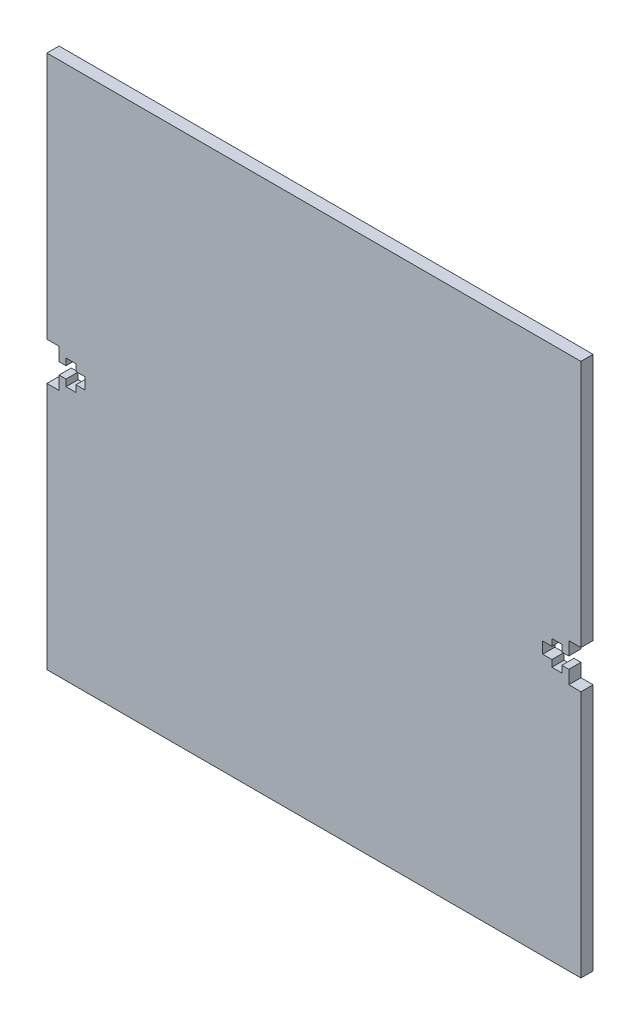
ISO-10303-21;
HEADER;
FILE_DESCRIPTION(('STEP AP214'),'2;1');
FILE_NAME('part.step','',(''),(''),'','','');
FILE_SCHEMA(('AUTOMOTIVE_DESIGN { 1 0 10303 214 1 1 1 1 }'));
ENDSEC;
DATA;
#1=APPLICATION_CONTEXT('core data for automotive mechanical design processes');
#2=APPLICATION_PROTOCOL_DEFINITION('international standard','automotive_design',2000,#1);
#3=PRODUCT_CONTEXT('',#1,'mechanical');
#4=PRODUCT('Part','Part','',(#3));
#5=PRODUCT_RELATED_PRODUCT_CATEGORY('part','',(#4));
#6=PRODUCT_DEFINITION_FORMATION('','',#4);
#7=PRODUCT_DEFINITION_CONTEXT('part definition',#1,'design');
#8=PRODUCT_DEFINITION('design','',#6,#7);
#9=PRODUCT_DEFINITION_SHAPE('','',#8);
#10=(LENGTH_UNIT() NAMED_UNIT(*) SI_UNIT(.MILLI.,.METRE.));
#11=(NAMED_UNIT(*) PLANE_ANGLE_UNIT() SI_UNIT($,.RADIAN.));
#12=(NAMED_UNIT(*) SI_UNIT($,.STERADIAN.) SOLID_ANGLE_UNIT());
#13=UNCERTAINTY_MEASURE_WITH_UNIT(LENGTH_MEASURE(1.E-05),#10,'distance_accuracy_value','');
#14=(GEOMETRIC_REPRESENTATION_CONTEXT(3) GLOBAL_UNCERTAINTY_ASSIGNED_CONTEXT((#13)) GLOBAL_UNIT_ASSIGNED_CONTEXT((#10,
#11,#12)) REPRESENTATION_CONTEXT('',''));
#15=CARTESIAN_POINT('',(0.,0.,0.));
#16=DIRECTION('',(0.,0.,1.));
#17=DIRECTION('',(1.,0.,0.));
#18=AXIS2_PLACEMENT_3D('',#15,#16,#17);
#19=CARTESIAN_POINT('',(69.85,69.85,3.18));
#20=DIRECTION('',(-1.,0.,0.));
#21=DIRECTION('',(0.,-1.,0.));
#22=AXIS2_PLACEMENT_3D('',#19,#20,#21);
#23=PLANE('',#22);
#24=DIRECTION('',(0.,1.,0.));
#25=VECTOR('',#24,1.);
#26=CARTESIAN_POINT('',(69.85,69.85,3.18));
#27=LINE('',#26,#25);
#28=CARTESIAN_POINT('',(69.85,5.00000000000001,3.18));
#29=VERTEX_POINT('',#28);
#30=CARTESIAN_POINT('',(69.85,69.85,3.18));
#31=VERTEX_POINT('',#30);
#32=EDGE_CURVE('E512',#29,#31,#27,.T.);
#33=ORIENTED_EDGE('',*,*,#32,.F.);
#34=DIRECTION('',(0.,0.,-1.));
#35=VECTOR('',#34,1.);
#36=CARTESIAN_POINT('',(69.85,5.00000000000001,10.));
#37=LINE('',#36,#35);
#38=CARTESIAN_POINT('',(69.85,5.00000000000001,0.));
#39=VERTEX_POINT('',#38);
#40=EDGE_CURVE('E329',#29,#39,#37,.T.);
#41=ORIENTED_EDGE('',*,*,#40,.T.);
#42=DIRECTION('',(0.,1.,0.));
#43=VECTOR('',#42,1.);
#44=CARTESIAN_POINT('',(69.85,69.85,0.));
#45=LINE('',#44,#43);
#46=CARTESIAN_POINT('',(69.85,69.85,0.));
#47=VERTEX_POINT('',#46);
#48=EDGE_CURVE('E477',#39,#47,#45,.T.);
#49=ORIENTED_EDGE('',*,*,#48,.T.);
#50=DIRECTION('',(0.,0.,-1.));
#51=VECTOR('',#50,1.);
#52=CARTESIAN_POINT('',(69.85,69.85,3.18));
#53=LINE('',#52,#51);
#54=EDGE_CURVE('E11',#31,#47,#53,.T.);
#55=ORIENTED_EDGE('',*,*,#54,.F.);
#56=EDGE_LOOP('',(#33,#41,#49,#55));
#57=FACE_BOUND('',#56,.T.);
#58=ADVANCED_FACE('F35',(#57),#23,.F.);
#59=CARTESIAN_POINT('',(-69.85,69.85,3.18));
#60=DIRECTION('',(1.,0.,0.));
#61=DIRECTION('',(0.,0.,-1.));
#62=AXIS2_PLACEMENT_3D('',#59,#60,#61);
#63=PLANE('',#62);
#64=DIRECTION('',(0.,-1.,0.));
#65=VECTOR('',#64,1.);
#66=CARTESIAN_POINT('',(-69.85,69.85,0.));
#67=LINE('',#66,#65);
#68=CARTESIAN_POINT('',(-69.85,69.85,0.));
#69=VERTEX_POINT('',#68);
#70=CARTESIAN_POINT('',(-69.85,5.00000000000001,0.));
#71=VERTEX_POINT('',#70);
#72=EDGE_CURVE('E526',#69,#71,#67,.T.);
#73=ORIENTED_EDGE('',*,*,#72,.T.);
#74=DIRECTION('',(0.,0.,-1.));
#75=VECTOR('',#74,1.);
#76=CARTESIAN_POINT('',(-69.85,5.00000000000001,3.18));
#77=LINE('',#76,#75);
#78=CARTESIAN_POINT('',(-69.85,5.00000000000001,3.18));
#79=VERTEX_POINT('',#78);
#80=EDGE_CURVE('E475',#79,#71,#77,.T.);
#81=ORIENTED_EDGE('',*,*,#80,.F.);
#82=DIRECTION('',(0.,-1.,0.));
#83=VECTOR('',#82,1.);
#84=CARTESIAN_POINT('',(-69.85,69.85,3.18));
#85=LINE('',#84,#83);
#86=CARTESIAN_POINT('',(-69.85,69.85,3.18));
#87=VERTEX_POINT('',#86);
#88=EDGE_CURVE('E515',#87,#79,#85,.T.);
#89=ORIENTED_EDGE('',*,*,#88,.F.);
#90=DIRECTION('',(0.,0.,-1.));
#91=VECTOR('',#90,1.);
#92=CARTESIAN_POINT('',(-69.85,69.85,3.18));
#93=LINE('',#92,#91);
#94=EDGE_CURVE('E43',#87,#69,#93,.T.);
#95=ORIENTED_EDGE('',*,*,#94,.T.);
#96=EDGE_LOOP('',(#73,#81,#89,#95));
#97=FACE_BOUND('',#96,.T.);
#98=ADVANCED_FACE('F540',(#97),#63,.F.);
#99=CARTESIAN_POINT('',(69.85,-69.85,0.));
#100=VERTEX_POINT('',#99);
#101=CARTESIAN_POINT('',(69.85,-5.,0.));
#102=VERTEX_POINT('',#101);
#103=EDGE_CURVE('E521',#100,#102,#45,.T.);
#104=ORIENTED_EDGE('',*,*,#103,.T.);
#105=DIRECTION('',(0.,0.,-1.));
#106=VECTOR('',#105,1.);
#107=CARTESIAN_POINT('',(69.85,-5.,10.));
#108=LINE('',#107,#106);
#109=CARTESIAN_POINT('',(69.85,-5.,3.18));
#110=VERTEX_POINT('',#109);
#111=EDGE_CURVE('E50',#110,#102,#108,.T.);
#112=ORIENTED_EDGE('',*,*,#111,.F.);
#113=CARTESIAN_POINT('',(69.85,-69.85,3.18));
#114=VERTEX_POINT('',#113);
#115=EDGE_CURVE('E508',#114,#110,#27,.T.);
#116=ORIENTED_EDGE('',*,*,#115,.F.);
#117=DIRECTION('',(0.,0.,-1.));
#118=VECTOR('',#117,1.);
#119=CARTESIAN_POINT('',(69.85,-69.85,3.18));
#120=LINE('',#119,#118);
#121=EDGE_CURVE('E520',#114,#100,#120,.T.);
#122=ORIENTED_EDGE('',*,*,#121,.T.);
#123=EDGE_LOOP('',(#104,#112,#116,#122));
#124=FACE_BOUND('',#123,.T.);
#125=ADVANCED_FACE('F37',(#124),#23,.F.);
#126=CARTESIAN_POINT('',(-69.85,69.85,3.18));
#127=DIRECTION('',(0.,-1.,0.));
#128=DIRECTION('',(0.,0.,-1.));
#129=AXIS2_PLACEMENT_3D('',#126,#127,#128);
#130=PLANE('',#129);
#131=DIRECTION('',(-1.,0.,0.));
#132=VECTOR('',#131,1.);
#133=CARTESIAN_POINT('',(-69.85,69.85,0.));
#134=LINE('',#133,#132);
#135=EDGE_CURVE('E523',#47,#69,#134,.T.);
#136=ORIENTED_EDGE('',*,*,#135,.T.);
#137=ORIENTED_EDGE('',*,*,#94,.F.);
#138=DIRECTION('',(-1.,0.,0.));
#139=VECTOR('',#138,1.);
#140=CARTESIAN_POINT('',(-69.85,69.85,3.18));
#141=LINE('',#140,#139);
#142=EDGE_CURVE('E511',#31,#87,#141,.T.);
#143=ORIENTED_EDGE('',*,*,#142,.F.);
#144=ORIENTED_EDGE('',*,*,#54,.T.);
#145=EDGE_LOOP('',(#136,#137,#143,#144));
#146=FACE_BOUND('',#145,.T.);
#147=ADVANCED_FACE('F558',(#146),#130,.F.);
#148=CARTESIAN_POINT('',(-69.85,-5.00000000000001,3.18));
#149=VERTEX_POINT('',#148);
#150=CARTESIAN_POINT('',(-69.85,-69.85,3.18));
#151=VERTEX_POINT('',#150);
#152=EDGE_CURVE('E514',#149,#151,#85,.T.);
#153=ORIENTED_EDGE('',*,*,#152,.F.);
#154=DIRECTION('',(0.,0.,-1.));
#155=VECTOR('',#154,1.);
#156=CARTESIAN_POINT('',(-69.85,-5.00000000000001,3.18));
#157=LINE('',#156,#155);
#158=CARTESIAN_POINT('',(-69.85,-5.00000000000001,0.));
#159=VERTEX_POINT('',#158);
#160=EDGE_CURVE('E478',#149,#159,#157,.T.);
#161=ORIENTED_EDGE('',*,*,#160,.T.);
#162=CARTESIAN_POINT('',(-69.85,-69.85,0.));
#163=VERTEX_POINT('',#162);
#164=EDGE_CURVE('E525',#159,#163,#67,.T.);
#165=ORIENTED_EDGE('',*,*,#164,.T.);
#166=DIRECTION('',(0.,0.,-1.));
#167=VECTOR('',#166,1.);
#168=CARTESIAN_POINT('',(-69.85,-69.85,3.18));
#169=LINE('',#168,#167);
#170=EDGE_CURVE('E533',#151,#163,#169,.T.);
#171=ORIENTED_EDGE('',*,*,#170,.F.);
#172=EDGE_LOOP('',(#153,#161,#165,#171));
#173=FACE_BOUND('',#172,.T.);
#174=ADVANCED_FACE('F633',(#173),#63,.F.);
#175=CARTESIAN_POINT('',(-69.85,-69.85,3.18));
#176=DIRECTION('',(0.,1.,0.));
#177=DIRECTION('',(0.,0.,1.));
#178=AXIS2_PLACEMENT_3D('',#175,#176,#177);
#179=PLANE('',#178);
#180=DIRECTION('',(1.,0.,0.));
#181=VECTOR('',#180,1.);
#182=CARTESIAN_POINT('',(-69.85,-69.85,0.));
#183=LINE('',#182,#181);
#184=EDGE_CURVE('E529',#163,#100,#183,.T.);
#185=ORIENTED_EDGE('',*,*,#184,.T.);
#186=ORIENTED_EDGE('',*,*,#121,.F.);
#187=DIRECTION('',(1.,0.,0.));
#188=VECTOR('',#187,1.);
#189=CARTESIAN_POINT('',(-69.85,-69.85,3.18));
#190=LINE('',#189,#188);
#191=EDGE_CURVE('E518',#151,#114,#190,.T.);
#192=ORIENTED_EDGE('',*,*,#191,.F.);
#193=ORIENTED_EDGE('',*,*,#170,.T.);
#194=EDGE_LOOP('',(#185,#186,#192,#193));
#195=FACE_BOUND('',#194,.T.);
#196=ADVANCED_FACE('F628',(#195),#179,.F.);
#197=CARTESIAN_POINT('',(0.,0.,3.18));
#198=DIRECTION('',(0.,0.,1.));
#199=DIRECTION('',(1.,0.,0.));
#200=AXIS2_PLACEMENT_3D('',#197,#198,#199);
#201=PLANE('',#200);
#202=DIRECTION('',(-1.,0.,0.));
#203=VECTOR('',#202,1.);
#204=CARTESIAN_POINT('',(0.,4.99999999999978,3.18));
#205=LINE('',#204,#203);
#206=CARTESIAN_POINT('',(66.6699999999999,5.,3.18));
#207=VERTEX_POINT('',#206);
#208=EDGE_CURVE('E385',#29,#207,#205,.T.);
#209=ORIENTED_EDGE('',*,*,#208,.F.);
#210=ORIENTED_EDGE('',*,*,#32,.T.);
#211=ORIENTED_EDGE('',*,*,#142,.T.);
#212=ORIENTED_EDGE('',*,*,#88,.T.);
#213=DIRECTION('',(1.,0.,0.));
#214=VECTOR('',#213,1.);
#215=CARTESIAN_POINT('',(-69.85,5.00000000000001,3.18));
#216=LINE('',#215,#214);
#217=CARTESIAN_POINT('',(-66.67,5.,3.18));
#218=VERTEX_POINT('',#217);
#219=EDGE_CURVE('E387',#79,#218,#216,.T.);
#220=ORIENTED_EDGE('',*,*,#219,.T.);
#221=DIRECTION('',(0.,-1.,0.));
#222=VECTOR('',#221,1.);
#223=CARTESIAN_POINT('',(-66.67,5.,3.18));
#224=LINE('',#223,#222);
#225=CARTESIAN_POINT('',(-66.67,1.5,3.18));
#226=VERTEX_POINT('',#225);
#227=EDGE_CURVE('E390',#218,#226,#224,.T.);
#228=ORIENTED_EDGE('',*,*,#227,.T.);
#229=DIRECTION('',(1.,0.,0.));
#230=VECTOR('',#229,1.);
#231=CARTESIAN_POINT('',(-66.67,1.5,3.18));
#232=LINE('',#231,#230);
#233=CARTESIAN_POINT('',(-64.85,1.5,3.18));
#234=VERTEX_POINT('',#233);
#235=EDGE_CURVE('E394',#226,#234,#232,.T.);
#236=ORIENTED_EDGE('',*,*,#235,.T.);
#237=DIRECTION('',(0.,1.,0.));
#238=VECTOR('',#237,1.);
#239=CARTESIAN_POINT('',(-64.85,3.25,3.18));
#240=LINE('',#239,#238);
#241=CARTESIAN_POINT('',(-64.85,3.25,3.18));
#242=VERTEX_POINT('',#241);
#243=EDGE_CURVE('E397',#234,#242,#240,.T.);
#244=ORIENTED_EDGE('',*,*,#243,.T.);
#245=DIRECTION('',(1.,0.,0.));
#246=VECTOR('',#245,1.);
#247=CARTESIAN_POINT('',(-64.85,3.25,3.18));
#248=LINE('',#247,#246);
#249=CARTESIAN_POINT('',(-62.25,3.25,3.18));
#250=VERTEX_POINT('',#249);
#251=EDGE_CURVE('E400',#242,#250,#248,.T.);
#252=ORIENTED_EDGE('',*,*,#251,.T.);
#253=DIRECTION('',(0.,-1.,0.));
#254=VECTOR('',#253,1.);
#255=CARTESIAN_POINT('',(-62.25,3.25,3.18));
#256=LINE('',#255,#254);
#257=CARTESIAN_POINT('',(-62.25,1.5,3.18));
#258=VERTEX_POINT('',#257);
#259=EDGE_CURVE('E403',#250,#258,#256,.T.);
#260=ORIENTED_EDGE('',*,*,#259,.T.);
#261=DIRECTION('',(1.,0.,0.));
#262=VECTOR('',#261,1.);
#263=CARTESIAN_POINT('',(-62.25,1.5,3.18));
#264=LINE('',#263,#262);
#265=CARTESIAN_POINT('',(-59.85,1.5,3.18));
#266=VERTEX_POINT('',#265);
#267=EDGE_CURVE('E406',#258,#266,#264,.T.);
#268=ORIENTED_EDGE('',*,*,#267,.T.);
#269=DIRECTION('',(0.,-1.,0.));
#270=VECTOR('',#269,1.);
#271=CARTESIAN_POINT('',(-59.85,1.5,3.18));
#272=LINE('',#271,#270);
#273=CARTESIAN_POINT('',(-59.85,-1.5,3.18));
#274=VERTEX_POINT('',#273);
#275=EDGE_CURVE('E409',#266,#274,#272,.T.);
#276=ORIENTED_EDGE('',*,*,#275,.T.);
#277=DIRECTION('',(-1.,0.,0.));
#278=VECTOR('',#277,1.);
#279=CARTESIAN_POINT('',(-62.25,-1.5,3.18));
#280=LINE('',#279,#278);
#281=CARTESIAN_POINT('',(-62.25,-1.5,3.18));
#282=VERTEX_POINT('',#281);
#283=EDGE_CURVE('E412',#274,#282,#280,.T.);
#284=ORIENTED_EDGE('',*,*,#283,.T.);
#285=DIRECTION('',(0.,-1.,0.));
#286=VECTOR('',#285,1.);
#287=CARTESIAN_POINT('',(-62.25,-1.5,3.18));
#288=LINE('',#287,#286);
#289=CARTESIAN_POINT('',(-62.25,-3.25,3.18));
#290=VERTEX_POINT('',#289);
#291=EDGE_CURVE('E415',#282,#290,#288,.T.);
#292=ORIENTED_EDGE('',*,*,#291,.T.);
#293=DIRECTION('',(-1.,0.,0.));
#294=VECTOR('',#293,1.);
#295=CARTESIAN_POINT('',(-64.85,-3.25,3.18));
#296=LINE('',#295,#294);
#297=CARTESIAN_POINT('',(-64.85,-3.25,3.18));
#298=VERTEX_POINT('',#297);
#299=EDGE_CURVE('E418',#290,#298,#296,.T.);
#300=ORIENTED_EDGE('',*,*,#299,.T.);
#301=DIRECTION('',(0.,1.,0.));
#302=VECTOR('',#301,1.);
#303=CARTESIAN_POINT('',(-64.85,-3.25,3.18));
#304=LINE('',#303,#302);
#305=CARTESIAN_POINT('',(-64.85,-1.5,3.18));
#306=VERTEX_POINT('',#305);
#307=EDGE_CURVE('E421',#298,#306,#304,.T.);
#308=ORIENTED_EDGE('',*,*,#307,.T.);
#309=DIRECTION('',(-1.,0.,0.));
#310=VECTOR('',#309,1.);
#311=CARTESIAN_POINT('',(-66.67,-1.5,3.18));
#312=LINE('',#311,#310);
#313=CARTESIAN_POINT('',(-66.67,-1.5,3.18));
#314=VERTEX_POINT('',#313);
#315=EDGE_CURVE('E424',#306,#314,#312,.T.);
#316=ORIENTED_EDGE('',*,*,#315,.T.);
#317=DIRECTION('',(0.,-1.,0.));
#318=VECTOR('',#317,1.);
#319=CARTESIAN_POINT('',(-66.67,-1.5,3.18));
#320=LINE('',#319,#318);
#321=CARTESIAN_POINT('',(-66.67,-5.,3.18));
#322=VERTEX_POINT('',#321);
#323=EDGE_CURVE('E427',#314,#322,#320,.T.);
#324=ORIENTED_EDGE('',*,*,#323,.T.);
#325=DIRECTION('',(-1.,0.,0.));
#326=VECTOR('',#325,1.);
#327=CARTESIAN_POINT('',(-69.85,-5.00000000000001,3.18));
#328=LINE('',#327,#326);
#329=EDGE_CURVE('E430',#322,#149,#328,.T.);
#330=ORIENTED_EDGE('',*,*,#329,.T.);
#331=ORIENTED_EDGE('',*,*,#152,.T.);
#332=ORIENTED_EDGE('',*,*,#191,.T.);
#333=ORIENTED_EDGE('',*,*,#115,.T.);
#334=DIRECTION('',(1.,0.,0.));
#335=VECTOR('',#334,1.);
#336=CARTESIAN_POINT('',(0.,-5.,3.18));
#337=LINE('',#336,#335);
#338=CARTESIAN_POINT('',(66.6699999999999,-5.,3.18));
#339=VERTEX_POINT('',#338);
#340=EDGE_CURVE('E332',#339,#110,#337,.T.);
#341=ORIENTED_EDGE('',*,*,#340,.F.);
#342=DIRECTION('',(0.,-1.,0.));
#343=VECTOR('',#342,1.);
#344=CARTESIAN_POINT('',(66.6699999999999,0.,3.18));
#345=LINE('',#344,#343);
#346=CARTESIAN_POINT('',(66.6699999999999,-1.5,3.18));
#347=VERTEX_POINT('',#346);
#348=EDGE_CURVE('E276',#347,#339,#345,.T.);
#349=ORIENTED_EDGE('',*,*,#348,.F.);
#350=DIRECTION('',(1.,0.,0.));
#351=VECTOR('',#350,1.);
#352=CARTESIAN_POINT('',(0.,-1.49999999999911,3.18));
#353=LINE('',#352,#351);
#354=CARTESIAN_POINT('',(64.8499999999999,-1.49999999999997,3.18));
#355=VERTEX_POINT('',#354);
#356=EDGE_CURVE('E361',#355,#347,#353,.T.);
#357=ORIENTED_EDGE('',*,*,#356,.F.);
#358=DIRECTION('',(0.,1.,0.));
#359=VECTOR('',#358,1.);
#360=CARTESIAN_POINT('',(64.8499999999999,1.54281349600588E-12,3.18));
#361=LINE('',#360,#359);
#362=CARTESIAN_POINT('',(64.85,-3.24999999999998,3.18));
#363=VERTEX_POINT('',#362);
#364=EDGE_CURVE('E363',#363,#355,#361,.T.);
#365=ORIENTED_EDGE('',*,*,#364,.F.);
#366=DIRECTION('',(1.,0.,0.));
#367=VECTOR('',#366,1.);
#368=CARTESIAN_POINT('',(0.,-3.24999999999999,3.18));
#369=LINE('',#368,#367);
#370=CARTESIAN_POINT('',(62.25,-3.24999999999998,3.18));
#371=VERTEX_POINT('',#370);
#372=EDGE_CURVE('E365',#371,#363,#369,.T.);
#373=ORIENTED_EDGE('',*,*,#372,.F.);
#374=DIRECTION('',(0.,-1.,0.));
#375=VECTOR('',#374,1.);
#376=CARTESIAN_POINT('',(62.25,0.,3.18));
#377=LINE('',#376,#375);
#378=CARTESIAN_POINT('',(62.25,-1.5,3.18));
#379=VERTEX_POINT('',#378);
#380=EDGE_CURVE('E367',#379,#371,#377,.T.);
#381=ORIENTED_EDGE('',*,*,#380,.F.);
#382=DIRECTION('',(1.,0.,0.));
#383=VECTOR('',#382,1.);
#384=CARTESIAN_POINT('',(0.,-1.5,3.18));
#385=LINE('',#384,#383);
#386=CARTESIAN_POINT('',(59.8499999999999,-1.5,3.18));
#387=VERTEX_POINT('',#386);
#388=EDGE_CURVE('E369',#387,#379,#385,.T.);
#389=ORIENTED_EDGE('',*,*,#388,.F.);
#390=DIRECTION('',(0.,-1.,0.));
#391=VECTOR('',#390,1.);
#392=CARTESIAN_POINT('',(59.8499999999999,0.,3.18));
#393=LINE('',#392,#391);
#394=CARTESIAN_POINT('',(59.8499999999999,1.50000000000001,3.18));
#395=VERTEX_POINT('',#394);
#396=EDGE_CURVE('E371',#395,#387,#393,.T.);
#397=ORIENTED_EDGE('',*,*,#396,.F.);
#398=DIRECTION('',(-1.,0.,0.));
#399=VECTOR('',#398,1.);
#400=CARTESIAN_POINT('',(0.,1.50000000000003,3.18));
#401=LINE('',#400,#399);
#402=CARTESIAN_POINT('',(62.2499999999999,1.50000000000001,3.18));
#403=VERTEX_POINT('',#402);
#404=EDGE_CURVE('E373',#403,#395,#401,.T.);
#405=ORIENTED_EDGE('',*,*,#404,.F.);
#406=DIRECTION('',(0.,-1.,0.));
#407=VECTOR('',#406,1.);
#408=CARTESIAN_POINT('',(62.2499999999999,0.,3.18));
#409=LINE('',#408,#407);
#410=CARTESIAN_POINT('',(62.2499999999999,3.24999999999999,3.18));
#411=VERTEX_POINT('',#410);
#412=EDGE_CURVE('E375',#411,#403,#409,.T.);
#413=ORIENTED_EDGE('',*,*,#412,.F.);
#414=DIRECTION('',(-1.,0.,0.));
#415=VECTOR('',#414,1.);
#416=CARTESIAN_POINT('',(0.,3.25,3.18));
#417=LINE('',#416,#415);
#418=CARTESIAN_POINT('',(64.85,3.24999999999999,3.18));
#419=VERTEX_POINT('',#418);
#420=EDGE_CURVE('E377',#419,#411,#417,.T.);
#421=ORIENTED_EDGE('',*,*,#420,.F.);
#422=DIRECTION('',(0.,1.,0.));
#423=VECTOR('',#422,1.);
#424=CARTESIAN_POINT('',(64.8499999999999,-1.54281349600589E-12,3.18));
#425=LINE('',#424,#423);
#426=CARTESIAN_POINT('',(64.8499999999999,1.5,3.18));
#427=VERTEX_POINT('',#426);
#428=EDGE_CURVE('E379',#427,#419,#425,.T.);
#429=ORIENTED_EDGE('',*,*,#428,.F.);
#430=DIRECTION('',(-1.,0.,0.));
#431=VECTOR('',#430,1.);
#432=CARTESIAN_POINT('',(0.,1.49999999999971,3.18));
#433=LINE('',#432,#431);
#434=CARTESIAN_POINT('',(66.6699999999999,1.50000000000001,3.18));
#435=VERTEX_POINT('',#434);
#436=EDGE_CURVE('E381',#435,#427,#433,.T.);
#437=ORIENTED_EDGE('',*,*,#436,.F.);
#438=DIRECTION('',(0.,-1.,0.));
#439=VECTOR('',#438,1.);
#440=CARTESIAN_POINT('',(66.6699999999999,0.,3.18));
#441=LINE('',#440,#439);
#442=EDGE_CURVE('E383',#207,#435,#441,.T.);
#443=ORIENTED_EDGE('',*,*,#442,.F.);
#444=EDGE_LOOP('',(#209,#210,#211,#212,#220,#228,#236,#244,#252,#260,#268,#276,#284,#292,#300,
#308,#316,#324,#330,#331,#332,#333,#341,#349,#357,#365,#373,#381,#389,#397,#405,#413,#421,#429,
#437,#443));
#445=FACE_BOUND('',#444,.T.);
#446=ADVANCED_FACE('F555',(#445),#201,.T.);
#447=CARTESIAN_POINT('',(0.,0.,0.));
#448=DIRECTION('',(0.,0.,1.));
#449=DIRECTION('',(1.,0.,0.));
#450=AXIS2_PLACEMENT_3D('',#447,#448,#449);
#451=PLANE('',#450);
#452=ORIENTED_EDGE('',*,*,#48,.F.);
#453=DIRECTION('',(1.,0.,0.));
#454=VECTOR('',#453,1.);
#455=CARTESIAN_POINT('',(69.85,5.00000000000001,0.));
#456=LINE('',#455,#454);
#457=CARTESIAN_POINT('',(66.6699999999999,5.,0.));
#458=VERTEX_POINT('',#457);
#459=EDGE_CURVE('E327',#458,#39,#456,.T.);
#460=ORIENTED_EDGE('',*,*,#459,.F.);
#461=DIRECTION('',(0.,1.,0.));
#462=VECTOR('',#461,1.);
#463=CARTESIAN_POINT('',(66.6699999999999,5.,0.));
#464=LINE('',#463,#462);
#465=CARTESIAN_POINT('',(66.6699999999999,1.50000000000001,0.));
#466=VERTEX_POINT('',#465);
#467=EDGE_CURVE('E324',#466,#458,#464,.T.);
#468=ORIENTED_EDGE('',*,*,#467,.F.);
#469=DIRECTION('',(1.,0.,0.));
#470=VECTOR('',#469,1.);
#471=CARTESIAN_POINT('',(66.6699999999999,1.50000000000001,0.));
#472=LINE('',#471,#470);
#473=CARTESIAN_POINT('',(64.8499999999999,1.5,0.));
#474=VERTEX_POINT('',#473);
#475=EDGE_CURVE('E321',#474,#466,#472,.T.);
#476=ORIENTED_EDGE('',*,*,#475,.F.);
#477=DIRECTION('',(0.,-1.,0.));
#478=VECTOR('',#477,1.);
#479=CARTESIAN_POINT('',(64.85,3.24999999999999,0.));
#480=LINE('',#479,#478);
#481=CARTESIAN_POINT('',(64.85,3.24999999999999,0.));
#482=VERTEX_POINT('',#481);
#483=EDGE_CURVE('E318',#482,#474,#480,.T.);
#484=ORIENTED_EDGE('',*,*,#483,.F.);
#485=DIRECTION('',(1.,0.,0.));
#486=VECTOR('',#485,1.);
#487=CARTESIAN_POINT('',(64.85,3.24999999999999,0.));
#488=LINE('',#487,#486);
#489=CARTESIAN_POINT('',(62.2499999999999,3.24999999999999,0.));
#490=VERTEX_POINT('',#489);
#491=EDGE_CURVE('E315',#490,#482,#488,.T.);
#492=ORIENTED_EDGE('',*,*,#491,.F.);
#493=DIRECTION('',(0.,1.,0.));
#494=VECTOR('',#493,1.);
#495=CARTESIAN_POINT('',(62.2499999999999,3.24999999999999,0.));
#496=LINE('',#495,#494);
#497=CARTESIAN_POINT('',(62.2499999999999,1.50000000000001,0.));
#498=VERTEX_POINT('',#497);
#499=EDGE_CURVE('E312',#498,#490,#496,.T.);
#500=ORIENTED_EDGE('',*,*,#499,.F.);
#501=DIRECTION('',(1.,0.,0.));
#502=VECTOR('',#501,1.);
#503=CARTESIAN_POINT('',(62.2499999999999,1.50000000000001,0.));
#504=LINE('',#503,#502);
#505=CARTESIAN_POINT('',(59.8499999999999,1.50000000000001,0.));
#506=VERTEX_POINT('',#505);
#507=EDGE_CURVE('E309',#506,#498,#504,.T.);
#508=ORIENTED_EDGE('',*,*,#507,.F.);
#509=DIRECTION('',(0.,1.,0.));
#510=VECTOR('',#509,1.);
#511=CARTESIAN_POINT('',(59.8499999999999,1.50000000000001,0.));
#512=LINE('',#511,#510);
#513=CARTESIAN_POINT('',(59.8499999999999,-1.5,0.));
#514=VERTEX_POINT('',#513);
#515=EDGE_CURVE('E306',#514,#506,#512,.T.);
#516=ORIENTED_EDGE('',*,*,#515,.F.);
#517=DIRECTION('',(-1.,0.,0.));
#518=VECTOR('',#517,1.);
#519=CARTESIAN_POINT('',(62.25,-1.5,0.));
#520=LINE('',#519,#518);
#521=CARTESIAN_POINT('',(62.25,-1.5,0.));
#522=VERTEX_POINT('',#521);
#523=EDGE_CURVE('E303',#522,#514,#520,.T.);
#524=ORIENTED_EDGE('',*,*,#523,.F.);
#525=DIRECTION('',(0.,1.,0.));
#526=VECTOR('',#525,1.);
#527=CARTESIAN_POINT('',(62.25,-1.5,0.));
#528=LINE('',#527,#526);
#529=CARTESIAN_POINT('',(62.25,-3.24999999999998,0.));
#530=VERTEX_POINT('',#529);
#531=EDGE_CURVE('E300',#530,#522,#528,.T.);
#532=ORIENTED_EDGE('',*,*,#531,.F.);
#533=DIRECTION('',(-1.,0.,0.));
#534=VECTOR('',#533,1.);
#535=CARTESIAN_POINT('',(64.85,-3.24999999999998,0.));
#536=LINE('',#535,#534);
#537=CARTESIAN_POINT('',(64.85,-3.24999999999998,0.));
#538=VERTEX_POINT('',#537);
#539=EDGE_CURVE('E297',#538,#530,#536,.T.);
#540=ORIENTED_EDGE('',*,*,#539,.F.);
#541=DIRECTION('',(0.,-1.,0.));
#542=VECTOR('',#541,1.);
#543=CARTESIAN_POINT('',(64.85,-3.24999999999998,0.));
#544=LINE('',#543,#542);
#545=CARTESIAN_POINT('',(64.8499999999999,-1.49999999999997,0.));
#546=VERTEX_POINT('',#545);
#547=EDGE_CURVE('E292',#546,#538,#544,.T.);
#548=ORIENTED_EDGE('',*,*,#547,.F.);
#549=DIRECTION('',(-1.,0.,0.));
#550=VECTOR('',#549,1.);
#551=CARTESIAN_POINT('',(66.6699999999999,-1.5,0.));
#552=LINE('',#551,#550);
#553=CARTESIAN_POINT('',(66.6699999999999,-1.5,0.));
#554=VERTEX_POINT('',#553);
#555=EDGE_CURVE('E290',#554,#546,#552,.T.);
#556=ORIENTED_EDGE('',*,*,#555,.F.);
#557=DIRECTION('',(0.,1.,0.));
#558=VECTOR('',#557,1.);
#559=CARTESIAN_POINT('',(66.6699999999999,-1.5,0.));
#560=LINE('',#559,#558);
#561=CARTESIAN_POINT('',(66.6699999999999,-5.,0.));
#562=VERTEX_POINT('',#561);
#563=EDGE_CURVE('E273',#562,#554,#560,.T.);
#564=ORIENTED_EDGE('',*,*,#563,.F.);
#565=DIRECTION('',(-1.,0.,0.));
#566=VECTOR('',#565,1.);
#567=CARTESIAN_POINT('',(66.6699999999999,-5.,0.));
#568=LINE('',#567,#566);
#569=EDGE_CURVE('E280',#102,#562,#568,.T.);
#570=ORIENTED_EDGE('',*,*,#569,.F.);
#571=ORIENTED_EDGE('',*,*,#103,.F.);
#572=ORIENTED_EDGE('',*,*,#184,.F.);
#573=ORIENTED_EDGE('',*,*,#164,.F.);
#574=DIRECTION('',(-1.,0.,0.));
#575=VECTOR('',#574,1.);
#576=CARTESIAN_POINT('',(-69.85,-5.00000000000001,0.));
#577=LINE('',#576,#575);
#578=CARTESIAN_POINT('',(-66.67,-5.,0.));
#579=VERTEX_POINT('',#578);
#580=EDGE_CURVE('E391',#579,#159,#577,.T.);
#581=ORIENTED_EDGE('',*,*,#580,.F.);
#582=DIRECTION('',(0.,-1.,0.));
#583=VECTOR('',#582,1.);
#584=CARTESIAN_POINT('',(-66.67,-1.5,0.));
#585=LINE('',#584,#583);
#586=CARTESIAN_POINT('',(-66.67,-1.5,0.));
#587=VERTEX_POINT('',#586);
#588=EDGE_CURVE('E471',#587,#579,#585,.T.);
#589=ORIENTED_EDGE('',*,*,#588,.F.);
#590=DIRECTION('',(-1.,0.,0.));
#591=VECTOR('',#590,1.);
#592=CARTESIAN_POINT('',(-66.67,-1.5,0.));
#593=LINE('',#592,#591);
#594=CARTESIAN_POINT('',(-64.85,-1.5,0.));
#595=VERTEX_POINT('',#594);
#596=EDGE_CURVE('E468',#595,#587,#593,.T.);
#597=ORIENTED_EDGE('',*,*,#596,.F.);
#598=DIRECTION('',(0.,1.,0.));
#599=VECTOR('',#598,1.);
#600=CARTESIAN_POINT('',(-64.85,-3.25,0.));
#601=LINE('',#600,#599);
#602=CARTESIAN_POINT('',(-64.85,-3.25,0.));
#603=VERTEX_POINT('',#602);
#604=EDGE_CURVE('E465',#603,#595,#601,.T.);
#605=ORIENTED_EDGE('',*,*,#604,.F.);
#606=DIRECTION('',(-1.,0.,0.));
#607=VECTOR('',#606,1.);
#608=CARTESIAN_POINT('',(-64.85,-3.25,0.));
#609=LINE('',#608,#607);
#610=CARTESIAN_POINT('',(-62.25,-3.25,0.));
#611=VERTEX_POINT('',#610);
#612=EDGE_CURVE('E462',#611,#603,#609,.T.);
#613=ORIENTED_EDGE('',*,*,#612,.F.);
#614=DIRECTION('',(0.,-1.,0.));
#615=VECTOR('',#614,1.);
#616=CARTESIAN_POINT('',(-62.25,-1.5,0.));
#617=LINE('',#616,#615);
#618=CARTESIAN_POINT('',(-62.25,-1.5,0.));
#619=VERTEX_POINT('',#618);
#620=EDGE_CURVE('E459',#619,#611,#617,.T.);
#621=ORIENTED_EDGE('',*,*,#620,.F.);
#622=DIRECTION('',(-1.,0.,0.));
#623=VECTOR('',#622,1.);
#624=CARTESIAN_POINT('',(-62.25,-1.5,0.));
#625=LINE('',#624,#623);
#626=CARTESIAN_POINT('',(-59.85,-1.5,0.));
#627=VERTEX_POINT('',#626);
#628=EDGE_CURVE('E456',#627,#619,#625,.T.);
#629=ORIENTED_EDGE('',*,*,#628,.F.);
#630=DIRECTION('',(0.,-1.,0.));
#631=VECTOR('',#630,1.);
#632=CARTESIAN_POINT('',(-59.85,1.5,0.));
#633=LINE('',#632,#631);
#634=CARTESIAN_POINT('',(-59.85,1.5,0.));
#635=VERTEX_POINT('',#634);
#636=EDGE_CURVE('E453',#635,#627,#633,.T.);
#637=ORIENTED_EDGE('',*,*,#636,.F.);
#638=DIRECTION('',(1.,0.,0.));
#639=VECTOR('',#638,1.);
#640=CARTESIAN_POINT('',(-62.25,1.5,0.));
#641=LINE('',#640,#639);
#642=CARTESIAN_POINT('',(-62.25,1.5,0.));
#643=VERTEX_POINT('',#642);
#644=EDGE_CURVE('E450',#643,#635,#641,.T.);
#645=ORIENTED_EDGE('',*,*,#644,.F.);
#646=DIRECTION('',(0.,-1.,0.));
#647=VECTOR('',#646,1.);
#648=CARTESIAN_POINT('',(-62.25,3.25,0.));
#649=LINE('',#648,#647);
#650=CARTESIAN_POINT('',(-62.25,3.25,0.));
#651=VERTEX_POINT('',#650);
#652=EDGE_CURVE('E447',#651,#643,#649,.T.);
#653=ORIENTED_EDGE('',*,*,#652,.F.);
#654=DIRECTION('',(1.,0.,0.));
#655=VECTOR('',#654,1.);
#656=CARTESIAN_POINT('',(-64.85,3.25,0.));
#657=LINE('',#656,#655);
#658=CARTESIAN_POINT('',(-64.85,3.25,0.));
#659=VERTEX_POINT('',#658);
#660=EDGE_CURVE('E444',#659,#651,#657,.T.);
#661=ORIENTED_EDGE('',*,*,#660,.F.);
#662=DIRECTION('',(0.,1.,0.));
#663=VECTOR('',#662,1.);
#664=CARTESIAN_POINT('',(-64.85,3.25,0.));
#665=LINE('',#664,#663);
#666=CARTESIAN_POINT('',(-64.85,1.5,0.));
#667=VERTEX_POINT('',#666);
#668=EDGE_CURVE('E441',#667,#659,#665,.T.);
#669=ORIENTED_EDGE('',*,*,#668,.F.);
#670=DIRECTION('',(1.,0.,0.));
#671=VECTOR('',#670,1.);
#672=CARTESIAN_POINT('',(-66.67,1.5,0.));
#673=LINE('',#672,#671);
#674=CARTESIAN_POINT('',(-66.67,1.5,0.));
#675=VERTEX_POINT('',#674);
#676=EDGE_CURVE('E438',#675,#667,#673,.T.);
#677=ORIENTED_EDGE('',*,*,#676,.F.);
#678=DIRECTION('',(0.,-1.,0.));
#679=VECTOR('',#678,1.);
#680=CARTESIAN_POINT('',(-66.67,5.,0.));
#681=LINE('',#680,#679);
#682=CARTESIAN_POINT('',(-66.67,5.,0.));
#683=VERTEX_POINT('',#682);
#684=EDGE_CURVE('E435',#683,#675,#681,.T.);
#685=ORIENTED_EDGE('',*,*,#684,.F.);
#686=DIRECTION('',(1.,0.,0.));
#687=VECTOR('',#686,1.);
#688=CARTESIAN_POINT('',(-69.85,5.00000000000001,0.));
#689=LINE('',#688,#687);
#690=EDGE_CURVE('E58',#71,#683,#689,.T.);
#691=ORIENTED_EDGE('',*,*,#690,.F.);
#692=ORIENTED_EDGE('',*,*,#72,.F.);
#693=ORIENTED_EDGE('',*,*,#135,.F.);
#694=EDGE_LOOP('',(#452,#460,#468,#476,#484,#492,#500,#508,#516,#524,#532,#540,#548,#556,#564,
#570,#571,#572,#573,#581,#589,#597,#605,#613,#621,#629,#637,#645,#653,#661,#669,#677,#685,#691,
#692,#693));
#695=FACE_BOUND('',#694,.T.);
#696=ADVANCED_FACE('F287',(#695),#451,.F.);
#697=CARTESIAN_POINT('',(-69.85,5.00000000000001,3.18));
#698=DIRECTION('',(0.,1.,0.));
#699=DIRECTION('',(-1.,0.,0.));
#700=AXIS2_PLACEMENT_3D('',#697,#698,#699);
#701=PLANE('',#700);
#702=ORIENTED_EDGE('',*,*,#690,.T.);
#703=DIRECTION('',(0.,0.,-1.));
#704=VECTOR('',#703,1.);
#705=CARTESIAN_POINT('',(-66.67,5.,3.18));
#706=LINE('',#705,#704);
#707=EDGE_CURVE('E433',#218,#683,#706,.T.);
#708=ORIENTED_EDGE('',*,*,#707,.F.);
#709=ORIENTED_EDGE('',*,*,#219,.F.);
#710=ORIENTED_EDGE('',*,*,#80,.T.);
#711=EDGE_LOOP('',(#702,#708,#709,#710));
#712=FACE_BOUND('',#711,.T.);
#713=ADVANCED_FACE('F552',(#712),#701,.F.);
#714=CARTESIAN_POINT('',(-69.85,-5.00000000000001,3.18));
#715=DIRECTION('',(0.,-1.,0.));
#716=DIRECTION('',(1.,0.,0.));
#717=AXIS2_PLACEMENT_3D('',#714,#715,#716);
#718=PLANE('',#717);
#719=ORIENTED_EDGE('',*,*,#580,.T.);
#720=ORIENTED_EDGE('',*,*,#160,.F.);
#721=ORIENTED_EDGE('',*,*,#329,.F.);
#722=DIRECTION('',(0.,0.,-1.));
#723=VECTOR('',#722,1.);
#724=CARTESIAN_POINT('',(-66.67,-5.,3.18));
#725=LINE('',#724,#723);
#726=EDGE_CURVE('E481',#322,#579,#725,.T.);
#727=ORIENTED_EDGE('',*,*,#726,.T.);
#728=EDGE_LOOP('',(#719,#720,#721,#727));
#729=FACE_BOUND('',#728,.T.);
#730=ADVANCED_FACE('F636',(#729),#718,.F.);
#731=CARTESIAN_POINT('',(-66.67,-1.5,3.18));
#732=DIRECTION('',(1.,0.,0.));
#733=DIRECTION('',(0.,0.,-1.));
#734=AXIS2_PLACEMENT_3D('',#731,#732,#733);
#735=PLANE('',#734);
#736=ORIENTED_EDGE('',*,*,#588,.T.);
#737=ORIENTED_EDGE('',*,*,#726,.F.);
#738=ORIENTED_EDGE('',*,*,#323,.F.);
#739=DIRECTION('',(0.,0.,-1.));
#740=VECTOR('',#739,1.);
#741=CARTESIAN_POINT('',(-66.67,-1.5,3.18));
#742=LINE('',#741,#740);
#743=EDGE_CURVE('E483',#314,#587,#742,.T.);
#744=ORIENTED_EDGE('',*,*,#743,.T.);
#745=EDGE_LOOP('',(#736,#737,#738,#744));
#746=FACE_BOUND('',#745,.T.);
#747=ADVANCED_FACE('F640',(#746),#735,.F.);
#748=CARTESIAN_POINT('',(-66.67,-1.5,3.18));
#749=DIRECTION('',(0.,-1.,0.));
#750=DIRECTION('',(0.,0.,-1.));
#751=AXIS2_PLACEMENT_3D('',#748,#749,#750);
#752=PLANE('',#751);
#753=ORIENTED_EDGE('',*,*,#596,.T.);
#754=ORIENTED_EDGE('',*,*,#743,.F.);
#755=ORIENTED_EDGE('',*,*,#315,.F.);
#756=DIRECTION('',(0.,0.,-1.));
#757=VECTOR('',#756,1.);
#758=CARTESIAN_POINT('',(-64.85,-1.5,3.18));
#759=LINE('',#758,#757);
#760=EDGE_CURVE('E485',#306,#595,#759,.T.);
#761=ORIENTED_EDGE('',*,*,#760,.T.);
#762=EDGE_LOOP('',(#753,#754,#755,#761));
#763=FACE_BOUND('',#762,.T.);
#764=ADVANCED_FACE('F646',(#763),#752,.F.);
#765=CARTESIAN_POINT('',(-64.85,-3.25,3.18));
#766=DIRECTION('',(-1.,0.,0.));
#767=DIRECTION('',(0.,0.,1.));
#768=AXIS2_PLACEMENT_3D('',#765,#766,#767);
#769=PLANE('',#768);
#770=ORIENTED_EDGE('',*,*,#604,.T.);
#771=ORIENTED_EDGE('',*,*,#760,.F.);
#772=ORIENTED_EDGE('',*,*,#307,.F.);
#773=DIRECTION('',(0.,0.,-1.));
#774=VECTOR('',#773,1.);
#775=CARTESIAN_POINT('',(-64.85,-3.25,3.18));
#776=LINE('',#775,#774);
#777=EDGE_CURVE('E487',#298,#603,#776,.T.);
#778=ORIENTED_EDGE('',*,*,#777,.T.);
#779=EDGE_LOOP('',(#770,#771,#772,#778));
#780=FACE_BOUND('',#779,.T.);
#781=ADVANCED_FACE('F649',(#780),#769,.F.);
#782=CARTESIAN_POINT('',(-64.85,-3.25,3.18));
#783=DIRECTION('',(0.,-1.,0.));
#784=DIRECTION('',(0.,0.,-1.));
#785=AXIS2_PLACEMENT_3D('',#782,#783,#784);
#786=PLANE('',#785);
#787=ORIENTED_EDGE('',*,*,#612,.T.);
#788=ORIENTED_EDGE('',*,*,#777,.F.);
#789=ORIENTED_EDGE('',*,*,#299,.F.);
#790=DIRECTION('',(0.,0.,-1.));
#791=VECTOR('',#790,1.);
#792=CARTESIAN_POINT('',(-62.25,-3.25,3.18));
#793=LINE('',#792,#791);
#794=EDGE_CURVE('E489',#290,#611,#793,.T.);
#795=ORIENTED_EDGE('',*,*,#794,.T.);
#796=EDGE_LOOP('',(#787,#788,#789,#795));
#797=FACE_BOUND('',#796,.T.);
#798=ADVANCED_FACE('F652',(#797),#786,.F.);
#799=CARTESIAN_POINT('',(-62.25,-1.5,3.18));
#800=DIRECTION('',(1.,0.,0.));
#801=DIRECTION('',(0.,0.,-1.));
#802=AXIS2_PLACEMENT_3D('',#799,#800,#801);
#803=PLANE('',#802);
#804=ORIENTED_EDGE('',*,*,#620,.T.);
#805=ORIENTED_EDGE('',*,*,#794,.F.);
#806=ORIENTED_EDGE('',*,*,#291,.F.);
#807=DIRECTION('',(0.,0.,-1.));
#808=VECTOR('',#807,1.);
#809=CARTESIAN_POINT('',(-62.25,-1.5,3.18));
#810=LINE('',#809,#808);
#811=EDGE_CURVE('E491',#282,#619,#810,.T.);
#812=ORIENTED_EDGE('',*,*,#811,.T.);
#813=EDGE_LOOP('',(#804,#805,#806,#812));
#814=FACE_BOUND('',#813,.T.);
#815=ADVANCED_FACE('F657',(#814),#803,.F.);
#816=CARTESIAN_POINT('',(-62.25,-1.5,3.18));
#817=DIRECTION('',(0.,-1.,0.));
#818=DIRECTION('',(0.,0.,-1.));
#819=AXIS2_PLACEMENT_3D('',#816,#817,#818);
#820=PLANE('',#819);
#821=ORIENTED_EDGE('',*,*,#628,.T.);
#822=ORIENTED_EDGE('',*,*,#811,.F.);
#823=ORIENTED_EDGE('',*,*,#283,.F.);
#824=DIRECTION('',(0.,0.,-1.));
#825=VECTOR('',#824,1.);
#826=CARTESIAN_POINT('',(-59.85,-1.5,3.18));
#827=LINE('',#826,#825);
#828=EDGE_CURVE('E493',#274,#627,#827,.T.);
#829=ORIENTED_EDGE('',*,*,#828,.T.);
#830=EDGE_LOOP('',(#821,#822,#823,#829));
#831=FACE_BOUND('',#830,.T.);
#832=ADVANCED_FACE('F661',(#831),#820,.F.);
#833=CARTESIAN_POINT('',(-59.85,1.5,3.18));
#834=DIRECTION('',(1.,0.,0.));
#835=DIRECTION('',(0.,0.,-1.));
#836=AXIS2_PLACEMENT_3D('',#833,#834,#835);
#837=PLANE('',#836);
#838=ORIENTED_EDGE('',*,*,#636,.T.);
#839=ORIENTED_EDGE('',*,*,#828,.F.);
#840=ORIENTED_EDGE('',*,*,#275,.F.);
#841=DIRECTION('',(0.,0.,-1.));
#842=VECTOR('',#841,1.);
#843=CARTESIAN_POINT('',(-59.85,1.5,3.18));
#844=LINE('',#843,#842);
#845=EDGE_CURVE('E495',#266,#635,#844,.T.);
#846=ORIENTED_EDGE('',*,*,#845,.T.);
#847=EDGE_LOOP('',(#838,#839,#840,#846));
#848=FACE_BOUND('',#847,.T.);
#849=ADVANCED_FACE('F664',(#848),#837,.F.);
#850=CARTESIAN_POINT('',(-62.25,1.5,3.18));
#851=DIRECTION('',(0.,1.,0.));
#852=DIRECTION('',(0.,0.,1.));
#853=AXIS2_PLACEMENT_3D('',#850,#851,#852);
#854=PLANE('',#853);
#855=ORIENTED_EDGE('',*,*,#644,.T.);
#856=ORIENTED_EDGE('',*,*,#845,.F.);
#857=ORIENTED_EDGE('',*,*,#267,.F.);
#858=DIRECTION('',(0.,0.,-1.));
#859=VECTOR('',#858,1.);
#860=CARTESIAN_POINT('',(-62.25,1.5,3.18));
#861=LINE('',#860,#859);
#862=EDGE_CURVE('E497',#258,#643,#861,.T.);
#863=ORIENTED_EDGE('',*,*,#862,.T.);
#864=EDGE_LOOP('',(#855,#856,#857,#863));
#865=FACE_BOUND('',#864,.T.);
#866=ADVANCED_FACE('F669',(#865),#854,.F.);
#867=CARTESIAN_POINT('',(-62.25,3.25,3.18));
#868=DIRECTION('',(1.,0.,0.));
#869=DIRECTION('',(0.,0.,-1.));
#870=AXIS2_PLACEMENT_3D('',#867,#868,#869);
#871=PLANE('',#870);
#872=ORIENTED_EDGE('',*,*,#652,.T.);
#873=ORIENTED_EDGE('',*,*,#862,.F.);
#874=ORIENTED_EDGE('',*,*,#259,.F.);
#875=DIRECTION('',(0.,0.,-1.));
#876=VECTOR('',#875,1.);
#877=CARTESIAN_POINT('',(-62.25,3.25,3.18));
#878=LINE('',#877,#876);
#879=EDGE_CURVE('E499',#250,#651,#878,.T.);
#880=ORIENTED_EDGE('',*,*,#879,.T.);
#881=EDGE_LOOP('',(#872,#873,#874,#880));
#882=FACE_BOUND('',#881,.T.);
#883=ADVANCED_FACE('F673',(#882),#871,.F.);
#884=CARTESIAN_POINT('',(-64.85,3.25,3.18));
#885=DIRECTION('',(0.,1.,0.));
#886=DIRECTION('',(-1.,0.,0.));
#887=AXIS2_PLACEMENT_3D('',#884,#885,#886);
#888=PLANE('',#887);
#889=ORIENTED_EDGE('',*,*,#660,.T.);
#890=ORIENTED_EDGE('',*,*,#879,.F.);
#891=ORIENTED_EDGE('',*,*,#251,.F.);
#892=DIRECTION('',(0.,0.,-1.));
#893=VECTOR('',#892,1.);
#894=CARTESIAN_POINT('',(-64.85,3.25,3.18));
#895=LINE('',#894,#893);
#896=EDGE_CURVE('E501',#242,#659,#895,.T.);
#897=ORIENTED_EDGE('',*,*,#896,.T.);
#898=EDGE_LOOP('',(#889,#890,#891,#897));
#899=FACE_BOUND('',#898,.T.);
#900=ADVANCED_FACE('F676',(#899),#888,.F.);
#901=CARTESIAN_POINT('',(-64.85,3.25,3.18));
#902=DIRECTION('',(-1.,0.,0.));
#903=DIRECTION('',(0.,0.,1.));
#904=AXIS2_PLACEMENT_3D('',#901,#902,#903);
#905=PLANE('',#904);
#906=ORIENTED_EDGE('',*,*,#668,.T.);
#907=ORIENTED_EDGE('',*,*,#896,.F.);
#908=ORIENTED_EDGE('',*,*,#243,.F.);
#909=DIRECTION('',(0.,0.,-1.));
#910=VECTOR('',#909,1.);
#911=CARTESIAN_POINT('',(-64.85,1.5,3.18));
#912=LINE('',#911,#910);
#913=EDGE_CURVE('E503',#234,#667,#912,.T.);
#914=ORIENTED_EDGE('',*,*,#913,.T.);
#915=EDGE_LOOP('',(#906,#907,#908,#914));
#916=FACE_BOUND('',#915,.T.);
#917=ADVANCED_FACE('F678',(#916),#905,.F.);
#918=CARTESIAN_POINT('',(-66.67,1.5,3.18));
#919=DIRECTION('',(0.,1.,0.));
#920=DIRECTION('',(0.,0.,1.));
#921=AXIS2_PLACEMENT_3D('',#918,#919,#920);
#922=PLANE('',#921);
#923=ORIENTED_EDGE('',*,*,#676,.T.);
#924=ORIENTED_EDGE('',*,*,#913,.F.);
#925=ORIENTED_EDGE('',*,*,#235,.F.);
#926=DIRECTION('',(0.,0.,-1.));
#927=VECTOR('',#926,1.);
#928=CARTESIAN_POINT('',(-66.67,1.5,3.18));
#929=LINE('',#928,#927);
#930=EDGE_CURVE('E505',#226,#675,#929,.T.);
#931=ORIENTED_EDGE('',*,*,#930,.T.);
#932=EDGE_LOOP('',(#923,#924,#925,#931));
#933=FACE_BOUND('',#932,.T.);
#934=ADVANCED_FACE('F681',(#933),#922,.F.);
#935=CARTESIAN_POINT('',(-66.67,5.,3.18));
#936=DIRECTION('',(1.,0.,0.));
#937=DIRECTION('',(0.,1.,0.));
#938=AXIS2_PLACEMENT_3D('',#935,#936,#937);
#939=PLANE('',#938);
#940=ORIENTED_EDGE('',*,*,#684,.T.);
#941=ORIENTED_EDGE('',*,*,#930,.F.);
#942=ORIENTED_EDGE('',*,*,#227,.F.);
#943=ORIENTED_EDGE('',*,*,#707,.T.);
#944=EDGE_LOOP('',(#940,#941,#942,#943));
#945=FACE_BOUND('',#944,.T.);
#946=ADVANCED_FACE('F549',(#945),#939,.F.);
#947=CARTESIAN_POINT('',(69.85,5.00000000000001,10.));
#948=DIRECTION('',(0.,1.,0.));
#949=DIRECTION('',(-1.,0.,0.));
#950=AXIS2_PLACEMENT_3D('',#947,#948,#949);
#951=PLANE('',#950);
#952=ORIENTED_EDGE('',*,*,#208,.T.);
#953=DIRECTION('',(0.,0.,-1.));
#954=VECTOR('',#953,1.);
#955=CARTESIAN_POINT('',(66.6699999999999,5.,10.));
#956=LINE('',#955,#954);
#957=EDGE_CURVE('E333',#207,#458,#956,.T.);
#958=ORIENTED_EDGE('',*,*,#957,.T.);
#959=ORIENTED_EDGE('',*,*,#459,.T.);
#960=ORIENTED_EDGE('',*,*,#40,.F.);
#961=EDGE_LOOP('',(#952,#958,#959,#960));
#962=FACE_BOUND('',#961,.T.);
#963=ADVANCED_FACE('F564',(#962),#951,.F.);
#964=CARTESIAN_POINT('',(66.6699999999999,5.,10.));
#965=DIRECTION('',(-1.,0.,0.));
#966=DIRECTION('',(0.,0.,1.));
#967=AXIS2_PLACEMENT_3D('',#964,#965,#966);
#968=PLANE('',#967);
#969=ORIENTED_EDGE('',*,*,#442,.T.);
#970=DIRECTION('',(0.,0.,-1.));
#971=VECTOR('',#970,1.);
#972=CARTESIAN_POINT('',(66.6699999999999,1.50000000000001,10.));
#973=LINE('',#972,#971);
#974=EDGE_CURVE('E335',#435,#466,#973,.T.);
#975=ORIENTED_EDGE('',*,*,#974,.T.);
#976=ORIENTED_EDGE('',*,*,#467,.T.);
#977=ORIENTED_EDGE('',*,*,#957,.F.);
#978=EDGE_LOOP('',(#969,#975,#976,#977));
#979=FACE_BOUND('',#978,.T.);
#980=ADVANCED_FACE('F568',(#979),#968,.F.);
#981=CARTESIAN_POINT('',(66.6699999999999,1.50000000000001,10.));
#982=DIRECTION('',(0.,1.,0.));
#983=DIRECTION('',(-1.,0.,0.));
#984=AXIS2_PLACEMENT_3D('',#981,#982,#983);
#985=PLANE('',#984);
#986=ORIENTED_EDGE('',*,*,#436,.T.);
#987=DIRECTION('',(0.,0.,-1.));
#988=VECTOR('',#987,1.);
#989=CARTESIAN_POINT('',(64.8499999999999,1.5,10.));
#990=LINE('',#989,#988);
#991=EDGE_CURVE('E337',#427,#474,#990,.T.);
#992=ORIENTED_EDGE('',*,*,#991,.T.);
#993=ORIENTED_EDGE('',*,*,#475,.T.);
#994=ORIENTED_EDGE('',*,*,#974,.F.);
#995=EDGE_LOOP('',(#986,#992,#993,#994));
#996=FACE_BOUND('',#995,.T.);
#997=ADVANCED_FACE('F572',(#996),#985,.F.);
#998=CARTESIAN_POINT('',(64.85,3.24999999999999,10.));
#999=DIRECTION('',(1.,0.,0.));
#1000=DIRECTION('',(0.,1.,0.));
#1001=AXIS2_PLACEMENT_3D('',#998,#999,#1000);
#1002=PLANE('',#1001);
#1003=ORIENTED_EDGE('',*,*,#428,.T.);
#1004=DIRECTION('',(0.,0.,-1.));
#1005=VECTOR('',#1004,1.);
#1006=CARTESIAN_POINT('',(64.85,3.24999999999999,10.));
#1007=LINE('',#1006,#1005);
#1008=EDGE_CURVE('E339',#419,#482,#1007,.T.);
#1009=ORIENTED_EDGE('',*,*,#1008,.T.);
#1010=ORIENTED_EDGE('',*,*,#483,.T.);
#1011=ORIENTED_EDGE('',*,*,#991,.F.);
#1012=EDGE_LOOP('',(#1003,#1009,#1010,#1011));
#1013=FACE_BOUND('',#1012,.T.);
#1014=ADVANCED_FACE('F578',(#1013),#1002,.F.);
#1015=CARTESIAN_POINT('',(64.85,3.24999999999999,10.));
#1016=DIRECTION('',(0.,1.,0.));
#1017=DIRECTION('',(-1.,0.,0.));
#1018=AXIS2_PLACEMENT_3D('',#1015,#1016,#1017);
#1019=PLANE('',#1018);
#1020=ORIENTED_EDGE('',*,*,#420,.T.);
#1021=DIRECTION('',(0.,0.,-1.));
#1022=VECTOR('',#1021,1.);
#1023=CARTESIAN_POINT('',(62.2499999999999,3.24999999999999,10.));
#1024=LINE('',#1023,#1022);
#1025=EDGE_CURVE('E341',#411,#490,#1024,.T.);
#1026=ORIENTED_EDGE('',*,*,#1025,.T.);
#1027=ORIENTED_EDGE('',*,*,#491,.T.);
#1028=ORIENTED_EDGE('',*,*,#1008,.F.);
#1029=EDGE_LOOP('',(#1020,#1026,#1027,#1028));
#1030=FACE_BOUND('',#1029,.T.);
#1031=ADVANCED_FACE('F583',(#1030),#1019,.F.);
#1032=CARTESIAN_POINT('',(62.2499999999999,3.24999999999999,10.));
#1033=DIRECTION('',(-1.,0.,0.));
#1034=DIRECTION('',(0.,0.,1.));
#1035=AXIS2_PLACEMENT_3D('',#1032,#1033,#1034);
#1036=PLANE('',#1035);
#1037=ORIENTED_EDGE('',*,*,#412,.T.);
#1038=DIRECTION('',(0.,0.,-1.));
#1039=VECTOR('',#1038,1.);
#1040=CARTESIAN_POINT('',(62.2499999999999,1.50000000000001,10.));
#1041=LINE('',#1040,#1039);
#1042=EDGE_CURVE('E343',#403,#498,#1041,.T.);
#1043=ORIENTED_EDGE('',*,*,#1042,.T.);
#1044=ORIENTED_EDGE('',*,*,#499,.T.);
#1045=ORIENTED_EDGE('',*,*,#1025,.F.);
#1046=EDGE_LOOP('',(#1037,#1043,#1044,#1045));
#1047=FACE_BOUND('',#1046,.T.);
#1048=ADVANCED_FACE('F587',(#1047),#1036,.F.);
#1049=CARTESIAN_POINT('',(62.2499999999999,1.50000000000001,10.));
#1050=DIRECTION('',(0.,1.,0.));
#1051=DIRECTION('',(-1.,0.,0.));
#1052=AXIS2_PLACEMENT_3D('',#1049,#1050,#1051);
#1053=PLANE('',#1052);
#1054=ORIENTED_EDGE('',*,*,#404,.T.);
#1055=DIRECTION('',(0.,0.,-1.));
#1056=VECTOR('',#1055,1.);
#1057=CARTESIAN_POINT('',(59.8499999999999,1.50000000000001,10.));
#1058=LINE('',#1057,#1056);
#1059=EDGE_CURVE('E345',#395,#506,#1058,.T.);
#1060=ORIENTED_EDGE('',*,*,#1059,.T.);
#1061=ORIENTED_EDGE('',*,*,#507,.T.);
#1062=ORIENTED_EDGE('',*,*,#1042,.F.);
#1063=EDGE_LOOP('',(#1054,#1060,#1061,#1062));
#1064=FACE_BOUND('',#1063,.T.);
#1065=ADVANCED_FACE('F593',(#1064),#1053,.F.);
#1066=CARTESIAN_POINT('',(59.8499999999999,1.50000000000001,10.));
#1067=DIRECTION('',(-1.,0.,0.));
#1068=DIRECTION('',(0.,0.,1.));
#1069=AXIS2_PLACEMENT_3D('',#1066,#1067,#1068);
#1070=PLANE('',#1069);
#1071=ORIENTED_EDGE('',*,*,#396,.T.);
#1072=DIRECTION('',(0.,0.,-1.));
#1073=VECTOR('',#1072,1.);
#1074=CARTESIAN_POINT('',(59.8499999999999,-1.5,10.));
#1075=LINE('',#1074,#1073);
#1076=EDGE_CURVE('E347',#387,#514,#1075,.T.);
#1077=ORIENTED_EDGE('',*,*,#1076,.T.);
#1078=ORIENTED_EDGE('',*,*,#515,.T.);
#1079=ORIENTED_EDGE('',*,*,#1059,.F.);
#1080=EDGE_LOOP('',(#1071,#1077,#1078,#1079));
#1081=FACE_BOUND('',#1080,.T.);
#1082=ADVANCED_FACE('F598',(#1081),#1070,.F.);
#1083=CARTESIAN_POINT('',(62.25,-1.5,10.));
#1084=DIRECTION('',(0.,-1.,0.));
#1085=DIRECTION('',(0.,0.,-1.));
#1086=AXIS2_PLACEMENT_3D('',#1083,#1084,#1085);
#1087=PLANE('',#1086);
#1088=ORIENTED_EDGE('',*,*,#388,.T.);
#1089=DIRECTION('',(0.,0.,-1.));
#1090=VECTOR('',#1089,1.);
#1091=CARTESIAN_POINT('',(62.25,-1.5,10.));
#1092=LINE('',#1091,#1090);
#1093=EDGE_CURVE('E349',#379,#522,#1092,.T.);
#1094=ORIENTED_EDGE('',*,*,#1093,.T.);
#1095=ORIENTED_EDGE('',*,*,#523,.T.);
#1096=ORIENTED_EDGE('',*,*,#1076,.F.);
#1097=EDGE_LOOP('',(#1088,#1094,#1095,#1096));
#1098=FACE_BOUND('',#1097,.T.);
#1099=ADVANCED_FACE('F602',(#1098),#1087,.F.);
#1100=CARTESIAN_POINT('',(62.25,-1.5,10.));
#1101=DIRECTION('',(-1.,0.,0.));
#1102=DIRECTION('',(0.,0.,1.));
#1103=AXIS2_PLACEMENT_3D('',#1100,#1101,#1102);
#1104=PLANE('',#1103);
#1105=ORIENTED_EDGE('',*,*,#380,.T.);
#1106=DIRECTION('',(0.,0.,-1.));
#1107=VECTOR('',#1106,1.);
#1108=CARTESIAN_POINT('',(62.25,-3.24999999999998,10.));
#1109=LINE('',#1108,#1107);
#1110=EDGE_CURVE('E351',#371,#530,#1109,.T.);
#1111=ORIENTED_EDGE('',*,*,#1110,.T.);
#1112=ORIENTED_EDGE('',*,*,#531,.T.);
#1113=ORIENTED_EDGE('',*,*,#1093,.F.);
#1114=EDGE_LOOP('',(#1105,#1111,#1112,#1113));
#1115=FACE_BOUND('',#1114,.T.);
#1116=ADVANCED_FACE('F607',(#1115),#1104,.F.);
#1117=CARTESIAN_POINT('',(64.85,-3.24999999999998,10.));
#1118=DIRECTION('',(0.,-1.,0.));
#1119=DIRECTION('',(1.,0.,0.));
#1120=AXIS2_PLACEMENT_3D('',#1117,#1118,#1119);
#1121=PLANE('',#1120);
#1122=ORIENTED_EDGE('',*,*,#372,.T.);
#1123=DIRECTION('',(0.,0.,-1.));
#1124=VECTOR('',#1123,1.);
#1125=CARTESIAN_POINT('',(64.85,-3.24999999999998,10.));
#1126=LINE('',#1125,#1124);
#1127=EDGE_CURVE('E353',#363,#538,#1126,.T.);
#1128=ORIENTED_EDGE('',*,*,#1127,.T.);
#1129=ORIENTED_EDGE('',*,*,#539,.T.);
#1130=ORIENTED_EDGE('',*,*,#1110,.F.);
#1131=EDGE_LOOP('',(#1122,#1128,#1129,#1130));
#1132=FACE_BOUND('',#1131,.T.);
#1133=ADVANCED_FACE('F612',(#1132),#1121,.F.);
#1134=CARTESIAN_POINT('',(64.85,-3.24999999999998,10.));
#1135=DIRECTION('',(1.,0.,0.));
#1136=DIRECTION('',(0.,1.,0.));
#1137=AXIS2_PLACEMENT_3D('',#1134,#1135,#1136);
#1138=PLANE('',#1137);
#1139=ORIENTED_EDGE('',*,*,#364,.T.);
#1140=DIRECTION('',(0.,0.,-1.));
#1141=VECTOR('',#1140,1.);
#1142=CARTESIAN_POINT('',(64.8499999999999,-1.49999999999997,10.));
#1143=LINE('',#1142,#1141);
#1144=EDGE_CURVE('E355',#355,#546,#1143,.T.);
#1145=ORIENTED_EDGE('',*,*,#1144,.T.);
#1146=ORIENTED_EDGE('',*,*,#547,.T.);
#1147=ORIENTED_EDGE('',*,*,#1127,.F.);
#1148=EDGE_LOOP('',(#1139,#1145,#1146,#1147));
#1149=FACE_BOUND('',#1148,.T.);
#1150=ADVANCED_FACE('F616',(#1149),#1138,.F.);
#1151=CARTESIAN_POINT('',(66.6699999999999,-1.5,10.));
#1152=DIRECTION('',(0.,-1.,0.));
#1153=DIRECTION('',(1.,0.,0.));
#1154=AXIS2_PLACEMENT_3D('',#1151,#1152,#1153);
#1155=PLANE('',#1154);
#1156=ORIENTED_EDGE('',*,*,#356,.T.);
#1157=DIRECTION('',(0.,0.,-1.));
#1158=VECTOR('',#1157,1.);
#1159=CARTESIAN_POINT('',(66.6699999999999,-1.5,10.));
#1160=LINE('',#1159,#1158);
#1161=EDGE_CURVE('E278',#347,#554,#1160,.T.);
#1162=ORIENTED_EDGE('',*,*,#1161,.T.);
#1163=ORIENTED_EDGE('',*,*,#555,.T.);
#1164=ORIENTED_EDGE('',*,*,#1144,.F.);
#1165=EDGE_LOOP('',(#1156,#1162,#1163,#1164));
#1166=FACE_BOUND('',#1165,.T.);
#1167=ADVANCED_FACE('F620',(#1166),#1155,.F.);
#1168=CARTESIAN_POINT('',(66.6699999999999,-1.5,10.));
#1169=DIRECTION('',(-1.,0.,0.));
#1170=DIRECTION('',(0.,0.,1.));
#1171=AXIS2_PLACEMENT_3D('',#1168,#1169,#1170);
#1172=PLANE('',#1171);
#1173=ORIENTED_EDGE('',*,*,#348,.T.);
#1174=DIRECTION('',(0.,0.,-1.));
#1175=VECTOR('',#1174,1.);
#1176=CARTESIAN_POINT('',(66.6699999999999,-5.,10.));
#1177=LINE('',#1176,#1175);
#1178=EDGE_CURVE('E269',#339,#562,#1177,.T.);
#1179=ORIENTED_EDGE('',*,*,#1178,.T.);
#1180=ORIENTED_EDGE('',*,*,#563,.T.);
#1181=ORIENTED_EDGE('',*,*,#1161,.F.);
#1182=EDGE_LOOP('',(#1173,#1179,#1180,#1181));
#1183=FACE_BOUND('',#1182,.T.);
#1184=ADVANCED_FACE('F270',(#1183),#1172,.F.);
#1185=CARTESIAN_POINT('',(66.6699999999999,-5.,10.));
#1186=DIRECTION('',(0.,-1.,0.));
#1187=DIRECTION('',(0.,0.,-1.));
#1188=AXIS2_PLACEMENT_3D('',#1185,#1186,#1187);
#1189=PLANE('',#1188);
#1190=ORIENTED_EDGE('',*,*,#340,.T.);
#1191=ORIENTED_EDGE('',*,*,#111,.T.);
#1192=ORIENTED_EDGE('',*,*,#569,.T.);
#1193=ORIENTED_EDGE('',*,*,#1178,.F.);
#1194=EDGE_LOOP('',(#1190,#1191,#1192,#1193));
#1195=FACE_BOUND('',#1194,.T.);
#1196=ADVANCED_FACE('F281',(#1195),#1189,.F.);
#1197=CLOSED_SHELL('',(#58,#98,#125,#147,#174,#196,#446,#696,#713,#730,#747,#764,#781,#798,#815,
#832,#849,#866,#883,#900,#917,#934,#946,#963,#980,#997,#1014,#1031,#1048,#1065,#1082,#1099,
#1116,#1133,#1150,#1167,#1184,#1196));
#1198=MANIFOLD_SOLID_BREP('B2',#1197);
#1199=ADVANCED_BREP_SHAPE_REPRESENTATION('',(#18,#1198),#14);
#1200=SHAPE_DEFINITION_REPRESENTATION(#9,#1199);
ENDSEC;
END-ISO-10303-21;
